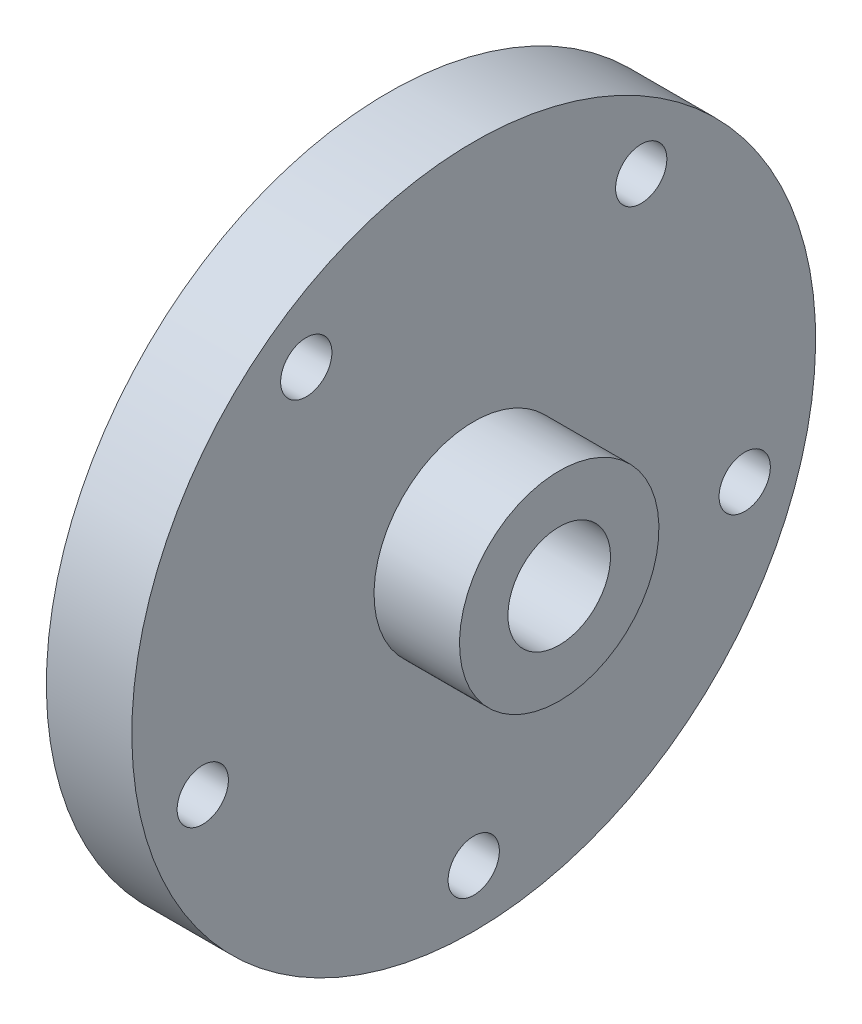
ISO-10303-21;
HEADER;
FILE_DESCRIPTION(('STEP AP214'),'2;1');
FILE_NAME('part.step','',(''),(''),'','','');
FILE_SCHEMA(('AUTOMOTIVE_DESIGN { 1 0 10303 214 1 1 1 1 }'));
ENDSEC;
DATA;
#1=APPLICATION_CONTEXT('core data for automotive mechanical design processes');
#2=APPLICATION_PROTOCOL_DEFINITION('international standard','automotive_design',2000,#1);
#3=PRODUCT_CONTEXT('',#1,'mechanical');
#4=PRODUCT('Part','Part','',(#3));
#5=PRODUCT_RELATED_PRODUCT_CATEGORY('part','',(#4));
#6=PRODUCT_DEFINITION_FORMATION('','',#4);
#7=PRODUCT_DEFINITION_CONTEXT('part definition',#1,'design');
#8=PRODUCT_DEFINITION('design','',#6,#7);
#9=PRODUCT_DEFINITION_SHAPE('','',#8);
#10=(LENGTH_UNIT() NAMED_UNIT(*) SI_UNIT(.MILLI.,.METRE.));
#11=(NAMED_UNIT(*) PLANE_ANGLE_UNIT() SI_UNIT($,.RADIAN.));
#12=(NAMED_UNIT(*) SI_UNIT($,.STERADIAN.) SOLID_ANGLE_UNIT());
#13=UNCERTAINTY_MEASURE_WITH_UNIT(LENGTH_MEASURE(1.E-05),#10,'distance_accuracy_value','');
#14=(GEOMETRIC_REPRESENTATION_CONTEXT(3) GLOBAL_UNCERTAINTY_ASSIGNED_CONTEXT((#13)) GLOBAL_UNIT_ASSIGNED_CONTEXT((#10,
#11,#12)) REPRESENTATION_CONTEXT('',''));
#15=CARTESIAN_POINT('',(0.,0.,0.));
#16=DIRECTION('',(0.,0.,1.));
#17=DIRECTION('',(1.,0.,0.));
#18=AXIS2_PLACEMENT_3D('',#15,#16,#17);
#19=CARTESIAN_POINT('',(-30.,0.,0.));
#20=DIRECTION('',(-1.,0.,0.));
#21=DIRECTION('',(0.,-1.,0.));
#22=AXIS2_PLACEMENT_3D('',#19,#20,#21);
#23=CYLINDRICAL_SURFACE('',#22,60.);
#24=CARTESIAN_POINT('',(-15.,0.,0.));
#25=DIRECTION('',(-1.,0.,0.));
#26=DIRECTION('',(0.,-1.,0.));
#27=AXIS2_PLACEMENT_3D('',#24,#25,#26);
#28=CIRCLE('',#27,60.);
#29=CARTESIAN_POINT('',(-15.,-60.,0.));
#30=VERTEX_POINT('',#29);
#31=EDGE_CURVE('E82',#30,#30,#28,.T.);
#32=ORIENTED_EDGE('',*,*,#31,.T.);
#33=EDGE_LOOP('',(#32));
#34=FACE_BOUND('',#33,.T.);
#35=CARTESIAN_POINT('',(-30.,0.,0.));
#36=DIRECTION('',(-1.,0.,0.));
#37=DIRECTION('',(0.,-1.,0.));
#38=AXIS2_PLACEMENT_3D('',#35,#36,#37);
#39=CIRCLE('',#38,60.);
#40=CARTESIAN_POINT('',(-30.,-60.,0.));
#41=VERTEX_POINT('',#40);
#42=EDGE_CURVE('E10',#41,#41,#39,.T.);
#43=ORIENTED_EDGE('',*,*,#42,.F.);
#44=EDGE_LOOP('',(#43));
#45=FACE_BOUND('',#44,.T.);
#46=ADVANCED_FACE('F39',(#34,#45),#23,.T.);
#47=CARTESIAN_POINT('',(-30.,0.,0.));
#48=DIRECTION('',(-1.,0.,0.));
#49=DIRECTION('',(0.,-1.,0.));
#50=AXIS2_PLACEMENT_3D('',#47,#48,#49);
#51=PLANE('',#50);
#52=CARTESIAN_POINT('',(-30.,-15.4508497187479,47.5528258147575));
#53=DIRECTION('',(-1.,0.,0.));
#54=DIRECTION('',(0.,-1.,0.));
#55=AXIS2_PLACEMENT_3D('',#52,#53,#54);
#56=CIRCLE('',#55,4.5);
#57=CARTESIAN_POINT('',(-30.,-19.9508497187479,47.5528258147575));
#58=VERTEX_POINT('',#57);
#59=EDGE_CURVE('E118',#58,#58,#56,.T.);
#60=ORIENTED_EDGE('',*,*,#59,.F.);
#61=EDGE_LOOP('',(#60));
#62=FACE_BOUND('',#61,.T.);
#63=CARTESIAN_POINT('',(-30.,40.4508497187471,29.389262614624));
#64=DIRECTION('',(-1.,0.,0.));
#65=DIRECTION('',(0.,-1.,0.));
#66=AXIS2_PLACEMENT_3D('',#63,#64,#65);
#67=CIRCLE('',#66,4.5);
#68=CARTESIAN_POINT('',(-30.,35.9508497187471,29.389262614624));
#69=VERTEX_POINT('',#68);
#70=EDGE_CURVE('E110',#69,#69,#67,.T.);
#71=ORIENTED_EDGE('',*,*,#70,.F.);
#72=EDGE_LOOP('',(#71));
#73=FACE_BOUND('',#72,.T.);
#74=CARTESIAN_POINT('',(-30.,40.4508497187475,-29.3892626146234));
#75=DIRECTION('',(-1.,0.,0.));
#76=DIRECTION('',(0.,-1.,0.));
#77=AXIS2_PLACEMENT_3D('',#74,#75,#76);
#78=CIRCLE('',#77,4.5);
#79=CARTESIAN_POINT('',(-30.,35.9508497187475,-29.3892626146234));
#80=VERTEX_POINT('',#79);
#81=EDGE_CURVE('E102',#80,#80,#78,.T.);
#82=ORIENTED_EDGE('',*,*,#81,.F.);
#83=EDGE_LOOP('',(#82));
#84=FACE_BOUND('',#83,.T.);
#85=CARTESIAN_POINT('',(-30.,-15.4508497187472,-47.5528258147577));
#86=DIRECTION('',(-1.,0.,0.));
#87=DIRECTION('',(0.,-1.,0.));
#88=AXIS2_PLACEMENT_3D('',#85,#86,#87);
#89=CIRCLE('',#88,4.5);
#90=CARTESIAN_POINT('',(-30.,-19.9508497187472,-47.5528258147577));
#91=VERTEX_POINT('',#90);
#92=EDGE_CURVE('E94',#91,#91,#89,.T.);
#93=ORIENTED_EDGE('',*,*,#92,.F.);
#94=EDGE_LOOP('',(#93));
#95=FACE_BOUND('',#94,.T.);
#96=CARTESIAN_POINT('',(-30.,-50.,0.));
#97=DIRECTION('',(-1.,0.,0.));
#98=DIRECTION('',(0.,-1.,0.));
#99=AXIS2_PLACEMENT_3D('',#96,#97,#98);
#100=CIRCLE('',#99,4.5);
#101=CARTESIAN_POINT('',(-30.,-54.5,0.));
#102=VERTEX_POINT('',#101);
#103=EDGE_CURVE('E86',#102,#102,#100,.T.);
#104=ORIENTED_EDGE('',*,*,#103,.F.);
#105=EDGE_LOOP('',(#104));
#106=FACE_BOUND('',#105,.T.);
#107=ORIENTED_EDGE('',*,*,#42,.T.);
#108=EDGE_LOOP('',(#107));
#109=FACE_BOUND('',#108,.T.);
#110=CARTESIAN_POINT('',(-30.,0.,0.));
#111=DIRECTION('',(-1.,0.,0.));
#112=DIRECTION('',(0.,-1.,0.));
#113=AXIS2_PLACEMENT_3D('',#110,#111,#112);
#114=CIRCLE('',#113,37.5);
#115=CARTESIAN_POINT('',(-30.,-37.5,0.));
#116=VERTEX_POINT('',#115);
#117=EDGE_CURVE('E46',#116,#116,#114,.T.);
#118=ORIENTED_EDGE('',*,*,#117,.F.);
#119=EDGE_LOOP('',(#118));
#120=FACE_BOUND('',#119,.T.);
#121=ADVANCED_FACE('F183',(#62,#73,#84,#95,#106,#109,#120),#51,.T.);
#122=CARTESIAN_POINT('',(-30.,0.,0.));
#123=DIRECTION('',(-1.,0.,0.));
#124=DIRECTION('',(0.,-1.,0.));
#125=AXIS2_PLACEMENT_3D('',#122,#123,#124);
#126=CYLINDRICAL_SURFACE('',#125,37.5);
#127=ORIENTED_EDGE('',*,*,#117,.T.);
#128=EDGE_LOOP('',(#127));
#129=FACE_BOUND('',#128,.T.);
#130=CARTESIAN_POINT('',(-20.,0.,0.));
#131=DIRECTION('',(-1.,0.,0.));
#132=DIRECTION('',(0.,-1.,0.));
#133=AXIS2_PLACEMENT_3D('',#130,#131,#132);
#134=CIRCLE('',#133,37.5);
#135=CARTESIAN_POINT('',(-20.,-37.5,0.));
#136=VERTEX_POINT('',#135);
#137=EDGE_CURVE('E51',#136,#136,#134,.T.);
#138=ORIENTED_EDGE('',*,*,#137,.F.);
#139=EDGE_LOOP('',(#138));
#140=FACE_BOUND('',#139,.T.);
#141=ADVANCED_FACE('F179',(#129,#140),#126,.F.);
#142=CARTESIAN_POINT('',(-20.,0.,0.));
#143=DIRECTION('',(-1.,0.,0.));
#144=DIRECTION('',(0.,-1.,0.));
#145=AXIS2_PLACEMENT_3D('',#142,#143,#144);
#146=PLANE('',#145);
#147=ORIENTED_EDGE('',*,*,#137,.T.);
#148=EDGE_LOOP('',(#147));
#149=FACE_BOUND('',#148,.T.);
#150=CARTESIAN_POINT('',(-20.,0.,0.));
#151=DIRECTION('',(-1.,0.,0.));
#152=DIRECTION('',(0.,-1.,0.));
#153=AXIS2_PLACEMENT_3D('',#150,#151,#152);
#154=CIRCLE('',#153,12.5);
#155=CARTESIAN_POINT('',(-20.,-12.5,0.));
#156=VERTEX_POINT('',#155);
#157=EDGE_CURVE('E56',#156,#156,#154,.T.);
#158=ORIENTED_EDGE('',*,*,#157,.F.);
#159=EDGE_LOOP('',(#158));
#160=FACE_BOUND('',#159,.T.);
#161=ADVANCED_FACE('F173',(#149,#160),#146,.T.);
#162=CARTESIAN_POINT('',(-30.,0.,0.));
#163=DIRECTION('',(-1.,0.,0.));
#164=DIRECTION('',(0.,-1.,0.));
#165=AXIS2_PLACEMENT_3D('',#162,#163,#164);
#166=CYLINDRICAL_SURFACE('',#165,12.5);
#167=ORIENTED_EDGE('',*,*,#157,.T.);
#168=EDGE_LOOP('',(#167));
#169=FACE_BOUND('',#168,.T.);
#170=CARTESIAN_POINT('',(-30.,0.,0.));
#171=DIRECTION('',(-1.,0.,0.));
#172=DIRECTION('',(0.,-1.,0.));
#173=AXIS2_PLACEMENT_3D('',#170,#171,#172);
#174=CIRCLE('',#173,12.5);
#175=CARTESIAN_POINT('',(-30.,-12.5,0.));
#176=VERTEX_POINT('',#175);
#177=EDGE_CURVE('E62',#176,#176,#174,.T.);
#178=ORIENTED_EDGE('',*,*,#177,.F.);
#179=EDGE_LOOP('',(#178));
#180=FACE_BOUND('',#179,.T.);
#181=ADVANCED_FACE('F168',(#169,#180),#166,.T.);
#182=CARTESIAN_POINT('',(-30.,0.,0.));
#183=DIRECTION('',(1.,0.,0.));
#184=DIRECTION('',(0.,1.,0.));
#185=AXIS2_PLACEMENT_3D('',#182,#183,#184);
#186=PLANE('',#185);
#187=CARTESIAN_POINT('',(-30.,0.,0.));
#188=DIRECTION('',(-1.,0.,0.));
#189=DIRECTION('',(0.,-1.,0.));
#190=AXIS2_PLACEMENT_3D('',#187,#188,#189);
#191=CIRCLE('',#190,9.);
#192=CARTESIAN_POINT('',(-30.,-9.,0.));
#193=VERTEX_POINT('',#192);
#194=EDGE_CURVE('E66',#193,#193,#191,.T.);
#195=ORIENTED_EDGE('',*,*,#194,.F.);
#196=EDGE_LOOP('',(#195));
#197=FACE_BOUND('',#196,.T.);
#198=ORIENTED_EDGE('',*,*,#177,.T.);
#199=EDGE_LOOP('',(#198));
#200=FACE_BOUND('',#199,.T.);
#201=ADVANCED_FACE('F162',(#197,#200),#186,.F.);
#202=CARTESIAN_POINT('',(-30.,0.,0.));
#203=DIRECTION('',(-1.,0.,0.));
#204=DIRECTION('',(0.,-1.,0.));
#205=AXIS2_PLACEMENT_3D('',#202,#203,#204);
#206=CYLINDRICAL_SURFACE('',#205,9.);
#207=CARTESIAN_POINT('',(0.,0.,0.));
#208=DIRECTION('',(-1.,0.,0.));
#209=DIRECTION('',(0.,-1.,0.));
#210=AXIS2_PLACEMENT_3D('',#207,#208,#209);
#211=CIRCLE('',#210,9.);
#212=CARTESIAN_POINT('',(0.,-9.,0.));
#213=VERTEX_POINT('',#212);
#214=EDGE_CURVE('E70',#213,#213,#211,.T.);
#215=ORIENTED_EDGE('',*,*,#214,.F.);
#216=EDGE_LOOP('',(#215));
#217=FACE_BOUND('',#216,.T.);
#218=ORIENTED_EDGE('',*,*,#194,.T.);
#219=EDGE_LOOP('',(#218));
#220=FACE_BOUND('',#219,.T.);
#221=ADVANCED_FACE('F156',(#217,#220),#206,.F.);
#222=CARTESIAN_POINT('',(0.,0.,0.));
#223=DIRECTION('',(-1.,0.,0.));
#224=DIRECTION('',(0.,-1.,0.));
#225=AXIS2_PLACEMENT_3D('',#222,#223,#224);
#226=PLANE('',#225);
#227=CARTESIAN_POINT('',(0.,0.,0.));
#228=DIRECTION('',(-1.,0.,0.));
#229=DIRECTION('',(0.,-1.,0.));
#230=AXIS2_PLACEMENT_3D('',#227,#228,#229);
#231=CIRCLE('',#230,17.5);
#232=CARTESIAN_POINT('',(0.,-17.5,0.));
#233=VERTEX_POINT('',#232);
#234=EDGE_CURVE('E74',#233,#233,#231,.T.);
#235=ORIENTED_EDGE('',*,*,#234,.F.);
#236=EDGE_LOOP('',(#235));
#237=FACE_BOUND('',#236,.T.);
#238=ORIENTED_EDGE('',*,*,#214,.T.);
#239=EDGE_LOOP('',(#238));
#240=FACE_BOUND('',#239,.T.);
#241=ADVANCED_FACE('F150',(#237,#240),#226,.F.);
#242=CARTESIAN_POINT('',(-30.,0.,0.));
#243=DIRECTION('',(-1.,0.,0.));
#244=DIRECTION('',(0.,-1.,0.));
#245=AXIS2_PLACEMENT_3D('',#242,#243,#244);
#246=CYLINDRICAL_SURFACE('',#245,17.5);
#247=CARTESIAN_POINT('',(-15.,0.,0.));
#248=DIRECTION('',(-1.,0.,0.));
#249=DIRECTION('',(0.,-1.,0.));
#250=AXIS2_PLACEMENT_3D('',#247,#248,#249);
#251=CIRCLE('',#250,17.5);
#252=CARTESIAN_POINT('',(-15.,-17.5,0.));
#253=VERTEX_POINT('',#252);
#254=EDGE_CURVE('E78',#253,#253,#251,.T.);
#255=ORIENTED_EDGE('',*,*,#254,.F.);
#256=EDGE_LOOP('',(#255));
#257=FACE_BOUND('',#256,.T.);
#258=ORIENTED_EDGE('',*,*,#234,.T.);
#259=EDGE_LOOP('',(#258));
#260=FACE_BOUND('',#259,.T.);
#261=ADVANCED_FACE('F134',(#257,#260),#246,.T.);
#262=CARTESIAN_POINT('',(-15.,0.,0.));
#263=DIRECTION('',(-1.,0.,0.));
#264=DIRECTION('',(0.,-1.,0.));
#265=AXIS2_PLACEMENT_3D('',#262,#263,#264);
#266=PLANE('',#265);
#267=CARTESIAN_POINT('',(-15.,-15.4508497187479,47.5528258147575));
#268=DIRECTION('',(1.,0.,0.));
#269=DIRECTION('',(0.,0.,-1.));
#270=AXIS2_PLACEMENT_3D('',#267,#268,#269);
#271=CIRCLE('',#270,4.5);
#272=CARTESIAN_POINT('',(-15.,-15.4508497187479,43.0528258147575));
#273=VERTEX_POINT('',#272);
#274=EDGE_CURVE('E122',#273,#273,#271,.T.);
#275=ORIENTED_EDGE('',*,*,#274,.F.);
#276=EDGE_LOOP('',(#275));
#277=FACE_BOUND('',#276,.T.);
#278=CARTESIAN_POINT('',(-15.,40.4508497187471,29.389262614624));
#279=DIRECTION('',(1.,0.,0.));
#280=DIRECTION('',(0.,0.,-1.));
#281=AXIS2_PLACEMENT_3D('',#278,#279,#280);
#282=CIRCLE('',#281,4.5);
#283=CARTESIAN_POINT('',(-15.,40.4508497187471,24.889262614624));
#284=VERTEX_POINT('',#283);
#285=EDGE_CURVE('E114',#284,#284,#282,.T.);
#286=ORIENTED_EDGE('',*,*,#285,.F.);
#287=EDGE_LOOP('',(#286));
#288=FACE_BOUND('',#287,.T.);
#289=CARTESIAN_POINT('',(-15.,40.4508497187475,-29.3892626146234));
#290=DIRECTION('',(1.,0.,0.));
#291=DIRECTION('',(0.,0.,-1.));
#292=AXIS2_PLACEMENT_3D('',#289,#290,#291);
#293=CIRCLE('',#292,4.5);
#294=CARTESIAN_POINT('',(-15.,40.4508497187475,-33.8892626146234));
#295=VERTEX_POINT('',#294);
#296=EDGE_CURVE('E106',#295,#295,#293,.T.);
#297=ORIENTED_EDGE('',*,*,#296,.F.);
#298=EDGE_LOOP('',(#297));
#299=FACE_BOUND('',#298,.T.);
#300=CARTESIAN_POINT('',(-15.,-15.4508497187472,-47.5528258147577));
#301=DIRECTION('',(1.,0.,0.));
#302=DIRECTION('',(0.,0.,-1.));
#303=AXIS2_PLACEMENT_3D('',#300,#301,#302);
#304=CIRCLE('',#303,4.5);
#305=CARTESIAN_POINT('',(-15.,-15.4508497187472,-52.0528258147577));
#306=VERTEX_POINT('',#305);
#307=EDGE_CURVE('E98',#306,#306,#304,.T.);
#308=ORIENTED_EDGE('',*,*,#307,.F.);
#309=EDGE_LOOP('',(#308));
#310=FACE_BOUND('',#309,.T.);
#311=CARTESIAN_POINT('',(-15.,-50.,0.));
#312=DIRECTION('',(1.,0.,0.));
#313=DIRECTION('',(0.,0.,-1.));
#314=AXIS2_PLACEMENT_3D('',#311,#312,#313);
#315=CIRCLE('',#314,4.5);
#316=CARTESIAN_POINT('',(-15.,-50.,-4.5));
#317=VERTEX_POINT('',#316);
#318=EDGE_CURVE('E90',#317,#317,#315,.T.);
#319=ORIENTED_EDGE('',*,*,#318,.F.);
#320=EDGE_LOOP('',(#319));
#321=FACE_BOUND('',#320,.T.);
#322=ORIENTED_EDGE('',*,*,#31,.F.);
#323=EDGE_LOOP('',(#322));
#324=FACE_BOUND('',#323,.T.);
#325=ORIENTED_EDGE('',*,*,#254,.T.);
#326=EDGE_LOOP('',(#325));
#327=FACE_BOUND('',#326,.T.);
#328=ADVANCED_FACE('F130',(#277,#288,#299,#310,#321,#324,#327),#266,.F.);
#329=CARTESIAN_POINT('',(-15.,-50.,0.));
#330=DIRECTION('',(1.,0.,0.));
#331=DIRECTION('',(0.,0.,-1.));
#332=AXIS2_PLACEMENT_3D('',#329,#330,#331);
#333=CYLINDRICAL_SURFACE('',#332,4.5);
#334=ORIENTED_EDGE('',*,*,#318,.T.);
#335=EDGE_LOOP('',(#334));
#336=FACE_BOUND('',#335,.T.);
#337=ORIENTED_EDGE('',*,*,#103,.T.);
#338=EDGE_LOOP('',(#337));
#339=FACE_BOUND('',#338,.T.);
#340=ADVANCED_FACE('F133',(#336,#339),#333,.F.);
#341=CARTESIAN_POINT('',(-15.,-15.4508497187472,-47.5528258147577));
#342=DIRECTION('',(1.,0.,0.));
#343=DIRECTION('',(0.,0.,-1.));
#344=AXIS2_PLACEMENT_3D('',#341,#342,#343);
#345=CYLINDRICAL_SURFACE('',#344,4.5);
#346=ORIENTED_EDGE('',*,*,#307,.T.);
#347=EDGE_LOOP('',(#346));
#348=FACE_BOUND('',#347,.T.);
#349=ORIENTED_EDGE('',*,*,#92,.T.);
#350=EDGE_LOOP('',(#349));
#351=FACE_BOUND('',#350,.T.);
#352=ADVANCED_FACE('F206',(#348,#351),#345,.F.);
#353=CARTESIAN_POINT('',(-15.,40.4508497187475,-29.3892626146234));
#354=DIRECTION('',(1.,0.,0.));
#355=DIRECTION('',(0.,0.,-1.));
#356=AXIS2_PLACEMENT_3D('',#353,#354,#355);
#357=CYLINDRICAL_SURFACE('',#356,4.5);
#358=ORIENTED_EDGE('',*,*,#296,.T.);
#359=EDGE_LOOP('',(#358));
#360=FACE_BOUND('',#359,.T.);
#361=ORIENTED_EDGE('',*,*,#81,.T.);
#362=EDGE_LOOP('',(#361));
#363=FACE_BOUND('',#362,.T.);
#364=ADVANCED_FACE('F212',(#360,#363),#357,.F.);
#365=CARTESIAN_POINT('',(-15.,40.4508497187471,29.389262614624));
#366=DIRECTION('',(1.,0.,0.));
#367=DIRECTION('',(0.,0.,-1.));
#368=AXIS2_PLACEMENT_3D('',#365,#366,#367);
#369=CYLINDRICAL_SURFACE('',#368,4.5);
#370=ORIENTED_EDGE('',*,*,#285,.T.);
#371=EDGE_LOOP('',(#370));
#372=FACE_BOUND('',#371,.T.);
#373=ORIENTED_EDGE('',*,*,#70,.T.);
#374=EDGE_LOOP('',(#373));
#375=FACE_BOUND('',#374,.T.);
#376=ADVANCED_FACE('F218',(#372,#375),#369,.F.);
#377=CARTESIAN_POINT('',(-15.,-15.4508497187479,47.5528258147575));
#378=DIRECTION('',(1.,0.,0.));
#379=DIRECTION('',(0.,0.,-1.));
#380=AXIS2_PLACEMENT_3D('',#377,#378,#379);
#381=CYLINDRICAL_SURFACE('',#380,4.5);
#382=ORIENTED_EDGE('',*,*,#274,.T.);
#383=EDGE_LOOP('',(#382));
#384=FACE_BOUND('',#383,.T.);
#385=ORIENTED_EDGE('',*,*,#59,.T.);
#386=EDGE_LOOP('',(#385));
#387=FACE_BOUND('',#386,.T.);
#388=ADVANCED_FACE('F127',(#384,#387),#381,.F.);
#389=CLOSED_SHELL('',(#46,#121,#141,#161,#181,#201,#221,#241,#261,#328,#340,#352,#364,#376,#388));
#390=MANIFOLD_SOLID_BREP('B2',#389);
#391=ADVANCED_BREP_SHAPE_REPRESENTATION('',(#18,#390),#14);
#392=SHAPE_DEFINITION_REPRESENTATION(#9,#391);
ENDSEC;
END-ISO-10303-21;
